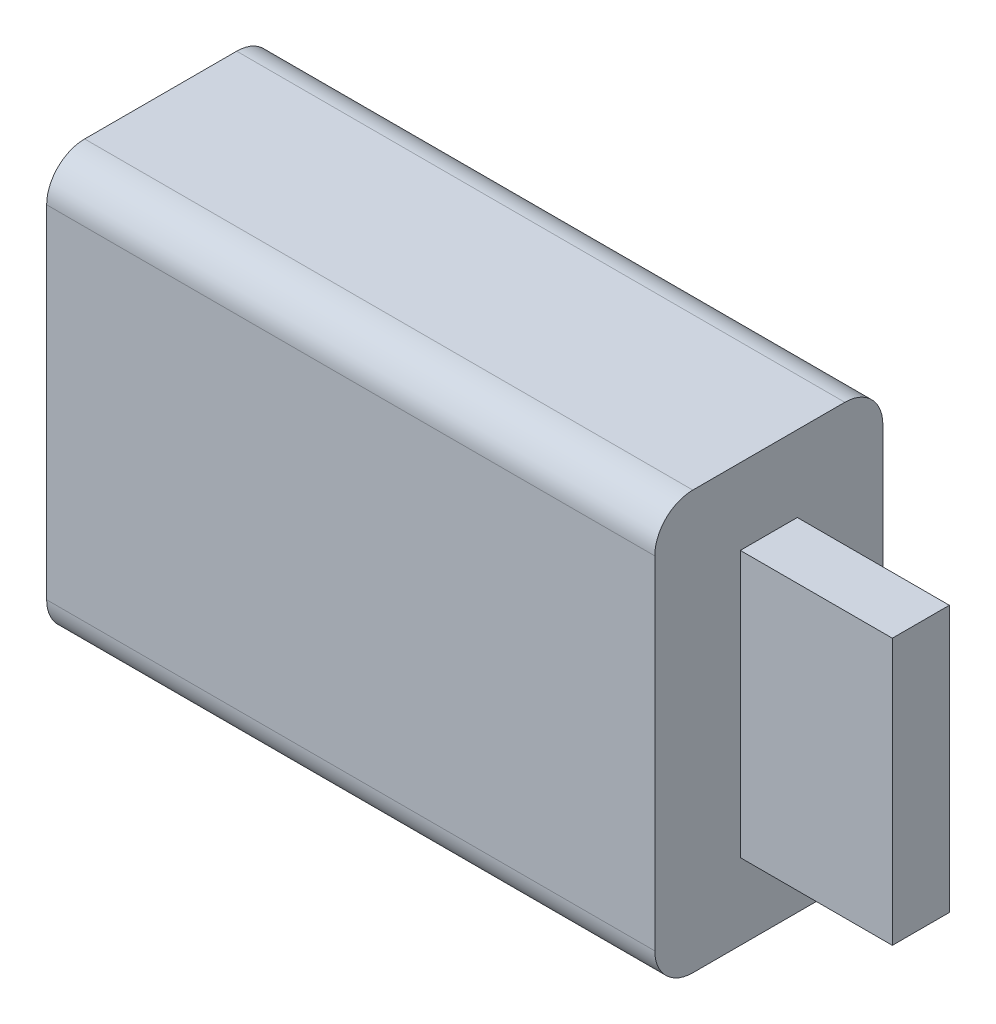
ISO-10303-21;
HEADER;
FILE_DESCRIPTION(('STEP AP214'),'2;1');
FILE_NAME('part.step','',(''),(''),'','','');
FILE_SCHEMA(('AUTOMOTIVE_DESIGN { 1 0 10303 214 1 1 1 1 }'));
ENDSEC;
DATA;
#1=APPLICATION_CONTEXT('core data for automotive mechanical design processes');
#2=APPLICATION_PROTOCOL_DEFINITION('international standard','automotive_design',2000,#1);
#3=PRODUCT_CONTEXT('',#1,'mechanical');
#4=PRODUCT('Part','Part','',(#3));
#5=PRODUCT_RELATED_PRODUCT_CATEGORY('part','',(#4));
#6=PRODUCT_DEFINITION_FORMATION('','',#4);
#7=PRODUCT_DEFINITION_CONTEXT('part definition',#1,'design');
#8=PRODUCT_DEFINITION('design','',#6,#7);
#9=PRODUCT_DEFINITION_SHAPE('','',#8);
#10=(LENGTH_UNIT() NAMED_UNIT(*) SI_UNIT(.MILLI.,.METRE.));
#11=(NAMED_UNIT(*) PLANE_ANGLE_UNIT() SI_UNIT($,.RADIAN.));
#12=(NAMED_UNIT(*) SI_UNIT($,.STERADIAN.) SOLID_ANGLE_UNIT());
#13=UNCERTAINTY_MEASURE_WITH_UNIT(LENGTH_MEASURE(1.E-05),#10,'distance_accuracy_value','');
#14=(GEOMETRIC_REPRESENTATION_CONTEXT(3) GLOBAL_UNCERTAINTY_ASSIGNED_CONTEXT((#13)) GLOBAL_UNIT_ASSIGNED_CONTEXT((#10,
#11,#12)) REPRESENTATION_CONTEXT('',''));
#15=CARTESIAN_POINT('',(0.,0.,0.));
#16=DIRECTION('',(0.,0.,1.));
#17=DIRECTION('',(1.,0.,0.));
#18=AXIS2_PLACEMENT_3D('',#15,#16,#17);
#19=CARTESIAN_POINT('',(8.,5.5,6.));
#20=DIRECTION('',(-1.,0.,0.));
#21=DIRECTION('',(0.,-1.,0.));
#22=AXIS2_PLACEMENT_3D('',#19,#20,#21);
#23=PLANE('',#22);
#24=DIRECTION('',(0.,0.,-1.));
#25=VECTOR('',#24,1.);
#26=CARTESIAN_POINT('',(8.,-5.5,6.));
#27=LINE('',#26,#25);
#28=CARTESIAN_POINT('',(8.,-5.5,5.));
#29=VERTEX_POINT('',#28);
#30=CARTESIAN_POINT('',(8.,-5.5,1.));
#31=VERTEX_POINT('',#30);
#32=EDGE_CURVE('E169',#29,#31,#27,.T.);
#33=ORIENTED_EDGE('',*,*,#32,.T.);
#34=CARTESIAN_POINT('',(8.,-4.5,1.));
#35=DIRECTION('',(-1.,0.,0.));
#36=DIRECTION('',(0.,-1.,0.));
#37=AXIS2_PLACEMENT_3D('',#34,#35,#36);
#38=CIRCLE('',#37,1.);
#39=CARTESIAN_POINT('',(8.,-4.5,0.));
#40=VERTEX_POINT('',#39);
#41=EDGE_CURVE('E205',#31,#40,#38,.F.);
#42=ORIENTED_EDGE('',*,*,#41,.T.);
#43=DIRECTION('',(0.,1.,0.));
#44=VECTOR('',#43,1.);
#45=CARTESIAN_POINT('',(8.,5.5,0.));
#46=LINE('',#45,#44);
#47=CARTESIAN_POINT('',(8.,4.5,0.));
#48=VERTEX_POINT('',#47);
#49=EDGE_CURVE('E151',#40,#48,#46,.T.);
#50=ORIENTED_EDGE('',*,*,#49,.T.);
#51=CARTESIAN_POINT('',(8.,4.5,1.));
#52=DIRECTION('',(-1.,0.,0.));
#53=DIRECTION('',(0.,-1.,0.));
#54=AXIS2_PLACEMENT_3D('',#51,#52,#53);
#55=CIRCLE('',#54,1.);
#56=CARTESIAN_POINT('',(8.,5.5,1.));
#57=VERTEX_POINT('',#56);
#58=EDGE_CURVE('E196',#48,#57,#55,.F.);
#59=ORIENTED_EDGE('',*,*,#58,.T.);
#60=DIRECTION('',(0.,0.,-1.));
#61=VECTOR('',#60,1.);
#62=CARTESIAN_POINT('',(8.,5.5,6.));
#63=LINE('',#62,#61);
#64=CARTESIAN_POINT('',(8.,5.5,5.));
#65=VERTEX_POINT('',#64);
#66=EDGE_CURVE('E185',#65,#57,#63,.T.);
#67=ORIENTED_EDGE('',*,*,#66,.F.);
#68=CARTESIAN_POINT('',(8.,4.5,5.));
#69=DIRECTION('',(-1.,0.,0.));
#70=DIRECTION('',(0.,-1.,0.));
#71=AXIS2_PLACEMENT_3D('',#68,#69,#70);
#72=CIRCLE('',#71,1.);
#73=CARTESIAN_POINT('',(8.,4.5,6.));
#74=VERTEX_POINT('',#73);
#75=EDGE_CURVE('E199',#65,#74,#72,.F.);
#76=ORIENTED_EDGE('',*,*,#75,.T.);
#77=DIRECTION('',(0.,1.,0.));
#78=VECTOR('',#77,1.);
#79=CARTESIAN_POINT('',(8.,5.5,6.));
#80=LINE('',#79,#78);
#81=CARTESIAN_POINT('',(8.,-4.5,6.));
#82=VERTEX_POINT('',#81);
#83=EDGE_CURVE('E162',#82,#74,#80,.T.);
#84=ORIENTED_EDGE('',*,*,#83,.F.);
#85=CARTESIAN_POINT('',(8.,-4.5,5.));
#86=DIRECTION('',(-1.,0.,0.));
#87=DIRECTION('',(0.,-1.,0.));
#88=AXIS2_PLACEMENT_3D('',#85,#86,#87);
#89=CIRCLE('',#88,1.);
#90=EDGE_CURVE('E202',#82,#29,#89,.F.);
#91=ORIENTED_EDGE('',*,*,#90,.T.);
#92=EDGE_LOOP('',(#33,#42,#50,#59,#67,#76,#84,#91));
#93=FACE_BOUND('',#92,.T.);
#94=DIRECTION('',(0.,1.,0.));
#95=VECTOR('',#94,1.);
#96=CARTESIAN_POINT('',(8.,3.5,2.25));
#97=LINE('',#96,#95);
#98=CARTESIAN_POINT('',(8.,-3.5,2.25));
#99=VERTEX_POINT('',#98);
#100=CARTESIAN_POINT('',(8.,3.5,2.25));
#101=VERTEX_POINT('',#100);
#102=EDGE_CURVE('E55',#99,#101,#97,.T.);
#103=ORIENTED_EDGE('',*,*,#102,.F.);
#104=DIRECTION('',(0.,0.,-1.));
#105=VECTOR('',#104,1.);
#106=CARTESIAN_POINT('',(8.,-3.5,3.75));
#107=LINE('',#106,#105);
#108=CARTESIAN_POINT('',(8.,-3.5,3.75));
#109=VERTEX_POINT('',#108);
#110=EDGE_CURVE('E59',#109,#99,#107,.T.);
#111=ORIENTED_EDGE('',*,*,#110,.F.);
#112=DIRECTION('',(0.,-1.,0.));
#113=VECTOR('',#112,1.);
#114=CARTESIAN_POINT('',(8.,3.5,3.75));
#115=LINE('',#114,#113);
#116=CARTESIAN_POINT('',(8.,3.5,3.75));
#117=VERTEX_POINT('',#116);
#118=EDGE_CURVE('E399',#117,#109,#115,.T.);
#119=ORIENTED_EDGE('',*,*,#118,.F.);
#120=DIRECTION('',(0.,0.,1.));
#121=VECTOR('',#120,1.);
#122=CARTESIAN_POINT('',(8.,3.5,3.75));
#123=LINE('',#122,#121);
#124=EDGE_CURVE('E409',#101,#117,#123,.T.);
#125=ORIENTED_EDGE('',*,*,#124,.F.);
#126=EDGE_LOOP('',(#103,#111,#119,#125));
#127=FACE_BOUND('',#126,.T.);
#128=ADVANCED_FACE('F39',(#93,#127),#23,.F.);
#129=CARTESIAN_POINT('',(-8.,5.5,6.));
#130=DIRECTION('',(0.,-1.,0.));
#131=DIRECTION('',(0.,0.,-1.));
#132=AXIS2_PLACEMENT_3D('',#129,#130,#131);
#133=PLANE('',#132);
#134=DIRECTION('',(0.,0.,-1.));
#135=VECTOR('',#134,1.);
#136=CARTESIAN_POINT('',(-8.,5.5,6.));
#137=LINE('',#136,#135);
#138=CARTESIAN_POINT('',(-8.,5.5,5.));
#139=VERTEX_POINT('',#138);
#140=CARTESIAN_POINT('',(-8.,5.5,1.));
#141=VERTEX_POINT('',#140);
#142=EDGE_CURVE('E181',#139,#141,#137,.T.);
#143=ORIENTED_EDGE('',*,*,#142,.F.);
#144=DIRECTION('',(-1.,0.,0.));
#145=VECTOR('',#144,1.);
#146=CARTESIAN_POINT('',(8.,5.5,5.));
#147=LINE('',#146,#145);
#148=EDGE_CURVE('E11',#139,#65,#147,.F.);
#149=ORIENTED_EDGE('',*,*,#148,.T.);
#150=ORIENTED_EDGE('',*,*,#66,.T.);
#151=DIRECTION('',(-1.,0.,0.));
#152=VECTOR('',#151,1.);
#153=CARTESIAN_POINT('',(-8.,5.5,1.));
#154=LINE('',#153,#152);
#155=EDGE_CURVE('E48',#57,#141,#154,.T.);
#156=ORIENTED_EDGE('',*,*,#155,.T.);
#157=EDGE_LOOP('',(#143,#149,#150,#156));
#158=FACE_BOUND('',#157,.T.);
#159=ADVANCED_FACE('F238',(#158),#133,.F.);
#160=CARTESIAN_POINT('',(-8.,5.5,6.));
#161=DIRECTION('',(1.,0.,0.));
#162=DIRECTION('',(0.,1.,0.));
#163=AXIS2_PLACEMENT_3D('',#160,#161,#162);
#164=PLANE('',#163);
#165=DIRECTION('',(0.,-1.,0.));
#166=VECTOR('',#165,1.);
#167=CARTESIAN_POINT('',(-8.,5.5,0.));
#168=LINE('',#167,#166);
#169=CARTESIAN_POINT('',(-8.,4.5,0.));
#170=VERTEX_POINT('',#169);
#171=CARTESIAN_POINT('',(-8.,-4.5,0.));
#172=VERTEX_POINT('',#171);
#173=EDGE_CURVE('E156',#170,#172,#168,.T.);
#174=ORIENTED_EDGE('',*,*,#173,.T.);
#175=CARTESIAN_POINT('',(-8.,-4.5,1.));
#176=DIRECTION('',(1.,0.,0.));
#177=DIRECTION('',(0.,1.,0.));
#178=AXIS2_PLACEMENT_3D('',#175,#176,#177);
#179=CIRCLE('',#178,1.);
#180=CARTESIAN_POINT('',(-8.,-5.5,1.));
#181=VERTEX_POINT('',#180);
#182=EDGE_CURVE('E223',#172,#181,#179,.F.);
#183=ORIENTED_EDGE('',*,*,#182,.T.);
#184=DIRECTION('',(0.,0.,-1.));
#185=VECTOR('',#184,1.);
#186=CARTESIAN_POINT('',(-8.,-5.5,6.));
#187=LINE('',#186,#185);
#188=CARTESIAN_POINT('',(-8.,-5.5,5.));
#189=VERTEX_POINT('',#188);
#190=EDGE_CURVE('E177',#189,#181,#187,.T.);
#191=ORIENTED_EDGE('',*,*,#190,.F.);
#192=CARTESIAN_POINT('',(-8.,-4.5,5.));
#193=DIRECTION('',(1.,0.,0.));
#194=DIRECTION('',(0.,1.,0.));
#195=AXIS2_PLACEMENT_3D('',#192,#193,#194);
#196=CIRCLE('',#195,1.);
#197=CARTESIAN_POINT('',(-8.,-4.5,6.));
#198=VERTEX_POINT('',#197);
#199=EDGE_CURVE('E220',#189,#198,#196,.F.);
#200=ORIENTED_EDGE('',*,*,#199,.T.);
#201=DIRECTION('',(0.,-1.,0.));
#202=VECTOR('',#201,1.);
#203=CARTESIAN_POINT('',(-8.,5.5,6.));
#204=LINE('',#203,#202);
#205=CARTESIAN_POINT('',(-8.,4.5,6.));
#206=VERTEX_POINT('',#205);
#207=EDGE_CURVE('E166',#206,#198,#204,.T.);
#208=ORIENTED_EDGE('',*,*,#207,.F.);
#209=CARTESIAN_POINT('',(-8.,4.5,5.));
#210=DIRECTION('',(1.,0.,0.));
#211=DIRECTION('',(0.,1.,0.));
#212=AXIS2_PLACEMENT_3D('',#209,#210,#211);
#213=CIRCLE('',#212,1.);
#214=EDGE_CURVE('E217',#206,#139,#213,.F.);
#215=ORIENTED_EDGE('',*,*,#214,.T.);
#216=ORIENTED_EDGE('',*,*,#142,.T.);
#217=CARTESIAN_POINT('',(-8.,4.5,1.));
#218=DIRECTION('',(1.,0.,0.));
#219=DIRECTION('',(0.,1.,0.));
#220=AXIS2_PLACEMENT_3D('',#217,#218,#219);
#221=CIRCLE('',#220,1.);
#222=EDGE_CURVE('E214',#141,#170,#221,.F.);
#223=ORIENTED_EDGE('',*,*,#222,.T.);
#224=EDGE_LOOP('',(#174,#183,#191,#200,#208,#215,#216,#223));
#225=FACE_BOUND('',#224,.T.);
#226=ADVANCED_FACE('F244',(#225),#164,.F.);
#227=CARTESIAN_POINT('',(-8.,-5.5,6.));
#228=DIRECTION('',(0.,1.,0.));
#229=DIRECTION('',(0.,0.,1.));
#230=AXIS2_PLACEMENT_3D('',#227,#228,#229);
#231=PLANE('',#230);
#232=ORIENTED_EDGE('',*,*,#190,.T.);
#233=DIRECTION('',(1.,0.,0.));
#234=VECTOR('',#233,1.);
#235=CARTESIAN_POINT('',(-8.,-5.5,1.));
#236=LINE('',#235,#234);
#237=EDGE_CURVE('E192',#181,#31,#236,.T.);
#238=ORIENTED_EDGE('',*,*,#237,.T.);
#239=ORIENTED_EDGE('',*,*,#32,.F.);
#240=DIRECTION('',(1.,0.,0.));
#241=VECTOR('',#240,1.);
#242=CARTESIAN_POINT('',(-8.,-5.5,5.));
#243=LINE('',#242,#241);
#244=EDGE_CURVE('E189',#29,#189,#243,.F.);
#245=ORIENTED_EDGE('',*,*,#244,.T.);
#246=EDGE_LOOP('',(#232,#238,#239,#245));
#247=FACE_BOUND('',#246,.T.);
#248=ADVANCED_FACE('F268',(#247),#231,.F.);
#249=CARTESIAN_POINT('',(0.,0.,6.));
#250=DIRECTION('',(0.,0.,1.));
#251=DIRECTION('',(1.,0.,0.));
#252=AXIS2_PLACEMENT_3D('',#249,#250,#251);
#253=PLANE('',#252);
#254=ORIENTED_EDGE('',*,*,#207,.T.);
#255=DIRECTION('',(1.,0.,0.));
#256=VECTOR('',#255,1.);
#257=CARTESIAN_POINT('',(8.,-4.5,6.));
#258=LINE('',#257,#256);
#259=EDGE_CURVE('E230',#198,#82,#258,.T.);
#260=ORIENTED_EDGE('',*,*,#259,.T.);
#261=ORIENTED_EDGE('',*,*,#83,.T.);
#262=DIRECTION('',(-1.,0.,0.));
#263=VECTOR('',#262,1.);
#264=CARTESIAN_POINT('',(-8.,4.5,6.));
#265=LINE('',#264,#263);
#266=EDGE_CURVE('E226',#74,#206,#265,.T.);
#267=ORIENTED_EDGE('',*,*,#266,.T.);
#268=EDGE_LOOP('',(#254,#260,#261,#267));
#269=FACE_BOUND('',#268,.T.);
#270=ADVANCED_FACE('F252',(#269),#253,.T.);
#271=CARTESIAN_POINT('',(0.,0.,0.));
#272=DIRECTION('',(0.,0.,1.));
#273=DIRECTION('',(1.,0.,0.));
#274=AXIS2_PLACEMENT_3D('',#271,#272,#273);
#275=PLANE('',#274);
#276=ORIENTED_EDGE('',*,*,#49,.F.);
#277=DIRECTION('',(1.,0.,0.));
#278=VECTOR('',#277,1.);
#279=CARTESIAN_POINT('',(0.,-4.5,0.));
#280=LINE('',#279,#278);
#281=EDGE_CURVE('E211',#40,#172,#280,.F.);
#282=ORIENTED_EDGE('',*,*,#281,.T.);
#283=ORIENTED_EDGE('',*,*,#173,.F.);
#284=DIRECTION('',(-1.,0.,0.));
#285=VECTOR('',#284,1.);
#286=CARTESIAN_POINT('',(0.,4.5,0.));
#287=LINE('',#286,#285);
#288=EDGE_CURVE('E208',#170,#48,#287,.F.);
#289=ORIENTED_EDGE('',*,*,#288,.T.);
#290=EDGE_LOOP('',(#276,#282,#283,#289));
#291=FACE_BOUND('',#290,.T.);
#292=ADVANCED_FACE('F260',(#291),#275,.F.);
#293=CARTESIAN_POINT('',(-8.,-4.5,1.));
#294=DIRECTION('',(1.,0.,0.));
#295=DIRECTION('',(0.,0.,-1.));
#296=AXIS2_PLACEMENT_3D('',#293,#294,#295);
#297=CYLINDRICAL_SURFACE('',#296,1.);
#298=ORIENTED_EDGE('',*,*,#182,.F.);
#299=ORIENTED_EDGE('',*,*,#281,.F.);
#300=ORIENTED_EDGE('',*,*,#41,.F.);
#301=ORIENTED_EDGE('',*,*,#237,.F.);
#302=EDGE_LOOP('',(#298,#299,#300,#301));
#303=FACE_BOUND('',#302,.T.);
#304=ADVANCED_FACE('F266',(#303),#297,.T.);
#305=CARTESIAN_POINT('',(0.,-4.5,5.));
#306=DIRECTION('',(-1.,0.,0.));
#307=DIRECTION('',(0.,0.,1.));
#308=AXIS2_PLACEMENT_3D('',#305,#306,#307);
#309=CYLINDRICAL_SURFACE('',#308,1.);
#310=ORIENTED_EDGE('',*,*,#199,.F.);
#311=ORIENTED_EDGE('',*,*,#244,.F.);
#312=ORIENTED_EDGE('',*,*,#90,.F.);
#313=ORIENTED_EDGE('',*,*,#259,.F.);
#314=EDGE_LOOP('',(#310,#311,#312,#313));
#315=FACE_BOUND('',#314,.T.);
#316=ADVANCED_FACE('F272',(#315),#309,.T.);
#317=CARTESIAN_POINT('',(0.,4.5,5.));
#318=DIRECTION('',(1.,0.,0.));
#319=DIRECTION('',(0.,0.,-1.));
#320=AXIS2_PLACEMENT_3D('',#317,#318,#319);
#321=CYLINDRICAL_SURFACE('',#320,1.);
#322=ORIENTED_EDGE('',*,*,#75,.F.);
#323=ORIENTED_EDGE('',*,*,#148,.F.);
#324=ORIENTED_EDGE('',*,*,#214,.F.);
#325=ORIENTED_EDGE('',*,*,#266,.F.);
#326=EDGE_LOOP('',(#322,#323,#324,#325));
#327=FACE_BOUND('',#326,.T.);
#328=ADVANCED_FACE('F250',(#327),#321,.T.);
#329=CARTESIAN_POINT('',(-8.,4.5,1.));
#330=DIRECTION('',(-1.,0.,0.));
#331=DIRECTION('',(0.,0.,1.));
#332=AXIS2_PLACEMENT_3D('',#329,#330,#331);
#333=CYLINDRICAL_SURFACE('',#332,1.);
#334=ORIENTED_EDGE('',*,*,#58,.F.);
#335=ORIENTED_EDGE('',*,*,#288,.F.);
#336=ORIENTED_EDGE('',*,*,#222,.F.);
#337=ORIENTED_EDGE('',*,*,#155,.F.);
#338=EDGE_LOOP('',(#334,#335,#336,#337));
#339=FACE_BOUND('',#338,.T.);
#340=ADVANCED_FACE('F41',(#339),#333,.T.);
#341=CARTESIAN_POINT('',(12.,3.5,2.25));
#342=DIRECTION('',(0.,0.,1.));
#343=DIRECTION('',(0.,-1.,0.));
#344=AXIS2_PLACEMENT_3D('',#341,#342,#343);
#345=PLANE('',#344);
#346=ORIENTED_EDGE('',*,*,#102,.T.);
#347=DIRECTION('',(-1.,0.,0.));
#348=VECTOR('',#347,1.);
#349=CARTESIAN_POINT('',(12.,3.5,2.25));
#350=LINE('',#349,#348);
#351=CARTESIAN_POINT('',(12.,3.5,2.25));
#352=VERTEX_POINT('',#351);
#353=EDGE_CURVE('E131',#352,#101,#350,.T.);
#354=ORIENTED_EDGE('',*,*,#353,.F.);
#355=DIRECTION('',(0.,1.,0.));
#356=VECTOR('',#355,1.);
#357=CARTESIAN_POINT('',(12.,3.5,2.25));
#358=LINE('',#357,#356);
#359=CARTESIAN_POINT('',(12.,-3.5,2.25));
#360=VERTEX_POINT('',#359);
#361=EDGE_CURVE('E138',#360,#352,#358,.T.);
#362=ORIENTED_EDGE('',*,*,#361,.F.);
#363=DIRECTION('',(-1.,0.,0.));
#364=VECTOR('',#363,1.);
#365=CARTESIAN_POINT('',(12.,-3.5,2.25));
#366=LINE('',#365,#364);
#367=EDGE_CURVE('E396',#360,#99,#366,.T.);
#368=ORIENTED_EDGE('',*,*,#367,.T.);
#369=EDGE_LOOP('',(#346,#354,#362,#368));
#370=FACE_BOUND('',#369,.T.);
#371=ADVANCED_FACE('F149',(#370),#345,.F.);
#372=CARTESIAN_POINT('',(12.,3.5,3.75));
#373=DIRECTION('',(0.,-1.,0.));
#374=DIRECTION('',(0.,0.,-1.));
#375=AXIS2_PLACEMENT_3D('',#372,#373,#374);
#376=PLANE('',#375);
#377=ORIENTED_EDGE('',*,*,#124,.T.);
#378=DIRECTION('',(-1.,0.,0.));
#379=VECTOR('',#378,1.);
#380=CARTESIAN_POINT('',(12.,3.5,3.75));
#381=LINE('',#380,#379);
#382=CARTESIAN_POINT('',(12.,3.5,3.75));
#383=VERTEX_POINT('',#382);
#384=EDGE_CURVE('E133',#383,#117,#381,.T.);
#385=ORIENTED_EDGE('',*,*,#384,.F.);
#386=DIRECTION('',(0.,0.,1.));
#387=VECTOR('',#386,1.);
#388=CARTESIAN_POINT('',(12.,3.5,3.75));
#389=LINE('',#388,#387);
#390=EDGE_CURVE('E126',#352,#383,#389,.T.);
#391=ORIENTED_EDGE('',*,*,#390,.F.);
#392=ORIENTED_EDGE('',*,*,#353,.T.);
#393=EDGE_LOOP('',(#377,#385,#391,#392));
#394=FACE_BOUND('',#393,.T.);
#395=ADVANCED_FACE('F129',(#394),#376,.F.);
#396=CARTESIAN_POINT('',(12.,3.5,3.75));
#397=DIRECTION('',(0.,0.,-1.));
#398=DIRECTION('',(0.,1.,0.));
#399=AXIS2_PLACEMENT_3D('',#396,#397,#398);
#400=PLANE('',#399);
#401=ORIENTED_EDGE('',*,*,#118,.T.);
#402=DIRECTION('',(-1.,0.,0.));
#403=VECTOR('',#402,1.);
#404=CARTESIAN_POINT('',(12.,-3.5,3.75));
#405=LINE('',#404,#403);
#406=CARTESIAN_POINT('',(12.,-3.5,3.75));
#407=VERTEX_POINT('',#406);
#408=EDGE_CURVE('E158',#407,#109,#405,.T.);
#409=ORIENTED_EDGE('',*,*,#408,.F.);
#410=DIRECTION('',(0.,-1.,0.));
#411=VECTOR('',#410,1.);
#412=CARTESIAN_POINT('',(12.,3.5,3.75));
#413=LINE('',#412,#411);
#414=EDGE_CURVE('E137',#383,#407,#413,.T.);
#415=ORIENTED_EDGE('',*,*,#414,.F.);
#416=ORIENTED_EDGE('',*,*,#384,.T.);
#417=EDGE_LOOP('',(#401,#409,#415,#416));
#418=FACE_BOUND('',#417,.T.);
#419=ADVANCED_FACE('F301',(#418),#400,.F.);
#420=CARTESIAN_POINT('',(12.,-3.5,3.75));
#421=DIRECTION('',(0.,1.,0.));
#422=DIRECTION('',(0.,0.,1.));
#423=AXIS2_PLACEMENT_3D('',#420,#421,#422);
#424=PLANE('',#423);
#425=ORIENTED_EDGE('',*,*,#110,.T.);
#426=ORIENTED_EDGE('',*,*,#367,.F.);
#427=DIRECTION('',(0.,0.,-1.));
#428=VECTOR('',#427,1.);
#429=CARTESIAN_POINT('',(12.,-3.5,3.75));
#430=LINE('',#429,#428);
#431=EDGE_CURVE('E143',#407,#360,#430,.T.);
#432=ORIENTED_EDGE('',*,*,#431,.F.);
#433=ORIENTED_EDGE('',*,*,#408,.T.);
#434=EDGE_LOOP('',(#425,#426,#432,#433));
#435=FACE_BOUND('',#434,.T.);
#436=ADVANCED_FACE('F304',(#435),#424,.F.);
#437=CARTESIAN_POINT('',(12.,0.,0.));
#438=DIRECTION('',(1.,0.,0.));
#439=DIRECTION('',(0.,0.,-1.));
#440=AXIS2_PLACEMENT_3D('',#437,#438,#439);
#441=PLANE('',#440);
#442=ORIENTED_EDGE('',*,*,#361,.T.);
#443=ORIENTED_EDGE('',*,*,#390,.T.);
#444=ORIENTED_EDGE('',*,*,#414,.T.);
#445=ORIENTED_EDGE('',*,*,#431,.T.);
#446=EDGE_LOOP('',(#442,#443,#444,#445));
#447=FACE_BOUND('',#446,.T.);
#448=ADVANCED_FACE('F141',(#447),#441,.T.);
#449=CLOSED_SHELL('',(#128,#159,#226,#248,#270,#292,#304,#316,#328,#340,#371,#395,#419,#436,#448));
#450=MANIFOLD_SOLID_BREP('B2',#449);
#451=ADVANCED_BREP_SHAPE_REPRESENTATION('',(#18,#450),#14);
#452=SHAPE_DEFINITION_REPRESENTATION(#9,#451);
ENDSEC;
END-ISO-10303-21;
